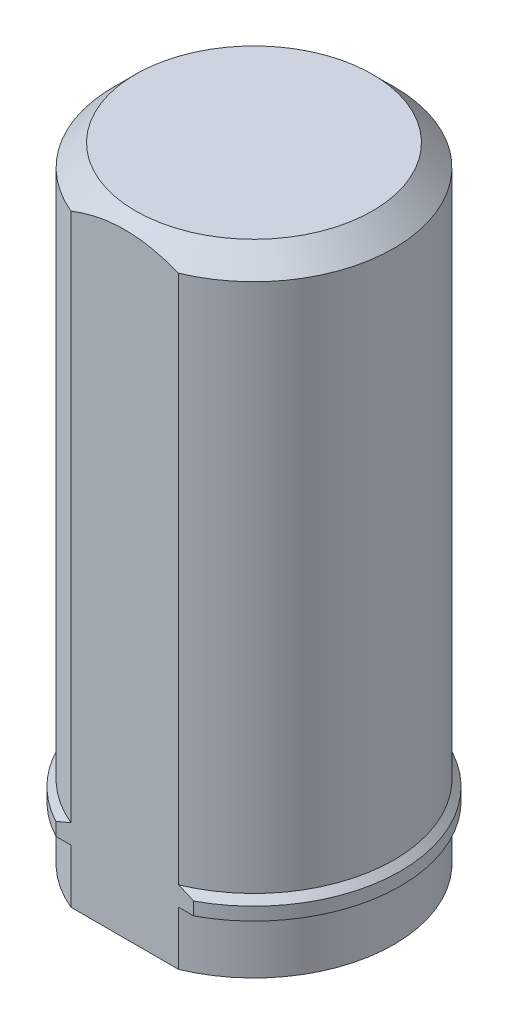
ISO-10303-21;
HEADER;
FILE_DESCRIPTION(('STEP AP214'),'2;1');
FILE_NAME('part.step','',(''),(''),'','','');
FILE_SCHEMA(('AUTOMOTIVE_DESIGN { 1 0 10303 214 1 1 1 1 }'));
ENDSEC;
DATA;
#1=APPLICATION_CONTEXT('core data for automotive mechanical design processes');
#2=APPLICATION_PROTOCOL_DEFINITION('international standard','automotive_design',2000,#1);
#3=PRODUCT_CONTEXT('',#1,'mechanical');
#4=PRODUCT('Part','Part','',(#3));
#5=PRODUCT_RELATED_PRODUCT_CATEGORY('part','',(#4));
#6=PRODUCT_DEFINITION_FORMATION('','',#4);
#7=PRODUCT_DEFINITION_CONTEXT('part definition',#1,'design');
#8=PRODUCT_DEFINITION('design','',#6,#7);
#9=PRODUCT_DEFINITION_SHAPE('','',#8);
#10=(LENGTH_UNIT() NAMED_UNIT(*) SI_UNIT(.MILLI.,.METRE.));
#11=(NAMED_UNIT(*) PLANE_ANGLE_UNIT() SI_UNIT($,.RADIAN.));
#12=(NAMED_UNIT(*) SI_UNIT($,.STERADIAN.) SOLID_ANGLE_UNIT());
#13=UNCERTAINTY_MEASURE_WITH_UNIT(LENGTH_MEASURE(1.E-05),#10,'distance_accuracy_value','');
#14=(GEOMETRIC_REPRESENTATION_CONTEXT(3) GLOBAL_UNCERTAINTY_ASSIGNED_CONTEXT((#13)) GLOBAL_UNIT_ASSIGNED_CONTEXT((#10,
#11,#12)) REPRESENTATION_CONTEXT('',''));
#15=CARTESIAN_POINT('',(0.,0.,0.));
#16=DIRECTION('',(0.,0.,1.));
#17=DIRECTION('',(1.,0.,0.));
#18=AXIS2_PLACEMENT_3D('',#15,#16,#17);
#19=CARTESIAN_POINT('',(0.,7.25,0.));
#20=DIRECTION('',(0.,-1.,0.));
#21=DIRECTION('',(0.,0.,-1.));
#22=AXIS2_PLACEMENT_3D('',#19,#20,#21);
#23=CYLINDRICAL_SURFACE('',#22,3.25);
#24=DIRECTION('',(0.,-1.,0.));
#25=VECTOR('',#24,1.);
#26=CARTESIAN_POINT('',(-1.25,7.25,3.));
#27=LINE('',#26,#25);
#28=CARTESIAN_POINT('',(-1.25,6.75000000000001,3.));
#29=VERTEX_POINT('',#28);
#30=CARTESIAN_POINT('',(-1.25,-5.55,3.));
#31=VERTEX_POINT('',#30);
#32=EDGE_CURVE('E153',#29,#31,#27,.T.);
#33=ORIENTED_EDGE('',*,*,#32,.F.);
#34=CARTESIAN_POINT('',(0.,6.75000000000001,0.));
#35=DIRECTION('',(0.,1.,0.));
#36=DIRECTION('',(0.,0.,1.));
#37=AXIS2_PLACEMENT_3D('',#34,#35,#36);
#38=CIRCLE('',#37,3.25);
#39=CARTESIAN_POINT('',(1.25,6.75000000000001,3.));
#40=VERTEX_POINT('',#39);
#41=EDGE_CURVE('E61',#29,#40,#38,.F.);
#42=ORIENTED_EDGE('',*,*,#41,.T.);
#43=DIRECTION('',(0.,-1.,0.));
#44=VECTOR('',#43,1.);
#45=CARTESIAN_POINT('',(1.25,7.25,3.));
#46=LINE('',#45,#44);
#47=CARTESIAN_POINT('',(1.25,-5.55,3.));
#48=VERTEX_POINT('',#47);
#49=EDGE_CURVE('E149',#40,#48,#46,.T.);
#50=ORIENTED_EDGE('',*,*,#49,.T.);
#51=CARTESIAN_POINT('',(0.,-5.55,0.));
#52=DIRECTION('',(0.,-1.,0.));
#53=DIRECTION('',(0.,0.,-1.));
#54=AXIS2_PLACEMENT_3D('',#51,#52,#53);
#55=CIRCLE('',#54,3.25);
#56=EDGE_CURVE('E217',#48,#31,#55,.F.);
#57=ORIENTED_EDGE('',*,*,#56,.T.);
#58=EDGE_LOOP('',(#33,#42,#50,#57));
#59=FACE_BOUND('',#58,.T.);
#60=ADVANCED_FACE('F45',(#59),#23,.T.);
#61=CARTESIAN_POINT('',(-1.25,-6.,3.));
#62=VERTEX_POINT('',#61);
#63=CARTESIAN_POINT('',(-1.25,-7.25,3.));
#64=VERTEX_POINT('',#63);
#65=EDGE_CURVE('E152',#62,#64,#27,.T.);
#66=ORIENTED_EDGE('',*,*,#65,.F.);
#67=CARTESIAN_POINT('',(0.,-6.,0.));
#68=DIRECTION('',(0.,1.,0.));
#69=DIRECTION('',(0.,0.,-1.));
#70=AXIS2_PLACEMENT_3D('',#67,#68,#69);
#71=CIRCLE('',#70,3.25);
#72=CARTESIAN_POINT('',(1.25,-6.,3.));
#73=VERTEX_POINT('',#72);
#74=EDGE_CURVE('E130',#73,#62,#71,.T.);
#75=ORIENTED_EDGE('',*,*,#74,.F.);
#76=CARTESIAN_POINT('',(1.25,-7.25,3.));
#77=VERTEX_POINT('',#76);
#78=EDGE_CURVE('E148',#73,#77,#46,.T.);
#79=ORIENTED_EDGE('',*,*,#78,.T.);
#80=CARTESIAN_POINT('',(0.,-7.25,0.));
#81=DIRECTION('',(0.,1.,0.));
#82=DIRECTION('',(0.,0.,1.));
#83=AXIS2_PLACEMENT_3D('',#80,#81,#82);
#84=CIRCLE('',#83,3.25);
#85=EDGE_CURVE('E139',#77,#64,#84,.T.);
#86=ORIENTED_EDGE('',*,*,#85,.T.);
#87=EDGE_LOOP('',(#66,#75,#79,#86));
#88=FACE_BOUND('',#87,.T.);
#89=ADVANCED_FACE('F179',(#88),#23,.T.);
#90=CARTESIAN_POINT('',(-1.25,7.25,3.));
#91=DIRECTION('',(0.,0.,-1.));
#92=DIRECTION('',(-1.,0.,0.));
#93=AXIS2_PLACEMENT_3D('',#90,#91,#92);
#94=PLANE('',#93);
#95=ORIENTED_EDGE('',*,*,#49,.F.);
#96=CARTESIAN_POINT('',(1.25,6.75000000000001,3.));
#97=CARTESIAN_POINT('',(1.15236802083106,6.78757188208299,3.));
#98=CARTESIAN_POINT('',(1.05336204969655,6.82188542634082,3.));
#99=CARTESIAN_POINT('',(0.852725448941352,6.88262653176156,3.));
#100=CARTESIAN_POINT('',(0.751089244504003,6.90903554399201,3.));
#101=CARTESIAN_POINT('',(0.548493250122635,6.95183525854424,3.));
#102=CARTESIAN_POINT('',(0.447586877927032,6.96847284308401,3.));
#103=CARTESIAN_POINT('',(0.244706115081653,6.99172007793595,3.));
#104=CARTESIAN_POINT('',(0.142732885989921,6.99833968153455,3.));
#105=CARTESIAN_POINT('',(-0.0578920074181172,7.00106149910393,3.));
#106=CARTESIAN_POINT('',(-0.156538957355593,6.99751300022703,3.));
#107=CARTESIAN_POINT('',(-0.353047249224431,6.98088604181037,3.));
#108=CARTESIAN_POINT('',(-0.450908287707392,6.96780406478675,3.));
#109=CARTESIAN_POINT('',(-0.646385819993977,6.93268347225142,3.));
#110=CARTESIAN_POINT('',(-0.743980132667017,6.91052325206171,3.));
#111=CARTESIAN_POINT('',(-0.937016203307972,6.85844563947066,3.));
#112=CARTESIAN_POINT('',(-1.03245832486016,6.82852956815261,3.));
#113=CARTESIAN_POINT('',(-1.32842957153947,6.72448834521904,3.));
#114=CARTESIAN_POINT('',(-1.52490969147314,6.63880361319598,3.));
#115=CARTESIAN_POINT('',(-1.81250176256392,6.49596689601506,3.));
#116=CARTESIAN_POINT('',(-1.9073559585764,6.44585780163771,3.));
#117=CARTESIAN_POINT('',(-2.0949245865654,6.34177437885116,3.));
#118=CARTESIAN_POINT('',(-2.18763938699841,6.28780072268413,3.));
#119=CARTESIAN_POINT('',(-2.36803930017189,6.17866081112151,3.));
#120=CARTESIAN_POINT('',(-2.45578798483036,6.12359847408629,3.));
#121=CARTESIAN_POINT('',(-2.62976374299445,6.01110837336085,3.));
#122=CARTESIAN_POINT('',(-2.71599069300595,5.95368041894191,3.));
#123=CARTESIAN_POINT('',(-2.88641961075783,5.83736099464282,3.));
#124=CARTESIAN_POINT('',(-2.97063234675969,5.77848523625161,3.));
#125=CARTESIAN_POINT('',(-3.13789321586835,5.65915034019606,3.));
#126=CARTESIAN_POINT('',(-3.22094167668753,5.59869166240205,3.));
#127=CARTESIAN_POINT('',(-3.30350342880282,5.5375864261465,3.));
#128=B_SPLINE_CURVE_WITH_KNOTS('',3,(#96,#97,#98,#99,#100,#101,#102,#103,#104,#105,#106,#107,
#108,#109,#110,#111,#112,#113,#114,#115,#116,#117,#118,#119,#120,#121,#122,#123,#124,#125,#126,
#127),.UNSPECIFIED.,.F.,.F.,(4,2,2,2,2,2,2,2,2,2,2,2,2,2,2,4),(0.,0.313947136940306,
0.628625314452548,0.934966611069564,1.24100334441469,1.53665464320436,1.83241508112558,
2.13227402606719,2.43208192842626,3.07316816171329,3.39497040337172,3.71671680275454,
4.02745936200869,4.33822702421668,4.64646590327191,4.95461620513625),.UNSPECIFIED.);
#129=EDGE_CURVE('E11',#40,#29,#128,.T.);
#130=ORIENTED_EDGE('',*,*,#129,.T.);
#131=ORIENTED_EDGE('',*,*,#32,.T.);
#132=CARTESIAN_POINT('',(-1.25,-5.55,3.));
#133=CARTESIAN_POINT('',(-1.27962939360583,-5.56139609884944,3.));
#134=CARTESIAN_POINT('',(-1.30914257840903,-5.57309239251102,3.));
#135=CARTESIAN_POINT('',(-1.36792931558873,-5.59704565204702,3.));
#136=CARTESIAN_POINT('',(-1.39720294374067,-5.60930243185636,3.));
#137=CARTESIAN_POINT('',(-1.45552217219404,-5.63434420136298,3.));
#138=CARTESIAN_POINT('',(-1.48456777802003,-5.64712917821573,3.));
#139=CARTESIAN_POINT('',(-1.54244546525888,-5.67319887731223,3.));
#140=CARTESIAN_POINT('',(-1.5712774731186,-5.68648376292557,3.));
#141=CARTESIAN_POINT('',(-1.60000000000004,-5.69999999999991,3.));
#142=B_SPLINE_CURVE_WITH_KNOTS('',3,(#132,#133,#134,#135,#136,#137,#138,#139,#140,#141),
.UNSPECIFIED.,.F.,.F.,(4,2,2,2,4),(0.,0.0952336420884847,0.190435895693011,0.285635835561755,
0.380867161552524),.UNSPECIFIED.);
#143=CARTESIAN_POINT('',(-1.6,-5.7,3.));
#144=VERTEX_POINT('',#143);
#145=EDGE_CURVE('E112',#31,#144,#142,.T.);
#146=ORIENTED_EDGE('',*,*,#145,.T.);
#147=DIRECTION('',(0.,-1.,0.));
#148=VECTOR('',#147,1.);
#149=CARTESIAN_POINT('',(-1.6,-5.5,3.));
#150=LINE('',#149,#148);
#151=CARTESIAN_POINT('',(-1.6,-6.,3.));
#152=VERTEX_POINT('',#151);
#153=EDGE_CURVE('E105',#144,#152,#150,.T.);
#154=ORIENTED_EDGE('',*,*,#153,.T.);
#155=DIRECTION('',(-1.,0.,0.));
#156=VECTOR('',#155,1.);
#157=CARTESIAN_POINT('',(-1.25,-6.,3.));
#158=LINE('',#157,#156);
#159=EDGE_CURVE('E109',#62,#152,#158,.T.);
#160=ORIENTED_EDGE('',*,*,#159,.F.);
#161=ORIENTED_EDGE('',*,*,#65,.T.);
#162=DIRECTION('',(1.,0.,0.));
#163=VECTOR('',#162,1.);
#164=CARTESIAN_POINT('',(-1.25,-7.25,3.));
#165=LINE('',#164,#163);
#166=EDGE_CURVE('E144',#64,#77,#165,.T.);
#167=ORIENTED_EDGE('',*,*,#166,.T.);
#168=ORIENTED_EDGE('',*,*,#78,.F.);
#169=DIRECTION('',(-1.,0.,0.));
#170=VECTOR('',#169,1.);
#171=CARTESIAN_POINT('',(1.25,-6.,3.));
#172=LINE('',#171,#170);
#173=CARTESIAN_POINT('',(1.6,-6.,3.));
#174=VERTEX_POINT('',#173);
#175=EDGE_CURVE('E118',#174,#73,#172,.T.);
#176=ORIENTED_EDGE('',*,*,#175,.F.);
#177=DIRECTION('',(0.,-1.,0.));
#178=VECTOR('',#177,1.);
#179=CARTESIAN_POINT('',(1.6,-5.5,3.));
#180=LINE('',#179,#178);
#181=CARTESIAN_POINT('',(1.6,-5.7,3.));
#182=VERTEX_POINT('',#181);
#183=EDGE_CURVE('E117',#182,#174,#180,.T.);
#184=ORIENTED_EDGE('',*,*,#183,.F.);
#185=CARTESIAN_POINT('',(1.6,-5.7,3.));
#186=CARTESIAN_POINT('',(1.57127747311859,-5.68648376292561,3.));
#187=CARTESIAN_POINT('',(1.54244546525888,-5.67319887731224,3.));
#188=CARTESIAN_POINT('',(1.48456777802004,-5.64712917821572,3.));
#189=CARTESIAN_POINT('',(1.45552217219405,-5.63434420136297,3.));
#190=CARTESIAN_POINT('',(1.39720294374067,-5.60930243185637,3.));
#191=CARTESIAN_POINT('',(1.36792931558873,-5.59704565204706,3.));
#192=CARTESIAN_POINT('',(1.30914257840906,-5.573092392511,3.));
#193=CARTESIAN_POINT('',(1.2796293936059,-5.56139609884933,3.));
#194=CARTESIAN_POINT('',(1.25000000000015,-5.54999999999969,3.));
#195=B_SPLINE_CURVE_WITH_KNOTS('',3,(#185,#186,#187,#188,#189,#190,#191,#192,#193,#194),
.UNSPECIFIED.,.F.,.F.,(4,2,2,2,4),(0.,0.0952313259907674,0.190431265859512,0.285633519464033,
0.380867161552509),.UNSPECIFIED.);
#196=EDGE_CURVE('E165',#182,#48,#195,.T.);
#197=ORIENTED_EDGE('',*,*,#196,.T.);
#198=EDGE_LOOP('',(#95,#130,#131,#146,#154,#160,#161,#167,#168,#176,#184,#197));
#199=FACE_BOUND('',#198,.T.);
#200=ADVANCED_FACE('F107',(#199),#94,.F.);
#201=CARTESIAN_POINT('',(0.,7.25,0.));
#202=DIRECTION('',(0.,1.,0.));
#203=DIRECTION('',(0.,0.,1.));
#204=AXIS2_PLACEMENT_3D('',#201,#202,#203);
#205=PLANE('',#204);
#206=CARTESIAN_POINT('',(0.,7.25,0.));
#207=DIRECTION('',(0.,1.,0.));
#208=DIRECTION('',(0.,0.,1.));
#209=AXIS2_PLACEMENT_3D('',#206,#207,#208);
#210=CIRCLE('',#209,2.75000000000001);
#211=CARTESIAN_POINT('',(1.05769230769231,7.25,2.53846153846155));
#212=VERTEX_POINT('',#211);
#213=EDGE_CURVE('E66',#212,#212,#210,.T.);
#214=ORIENTED_EDGE('',*,*,#213,.T.);
#215=EDGE_LOOP('',(#214));
#216=FACE_BOUND('',#215,.T.);
#217=ADVANCED_FACE('F178',(#216),#205,.T.);
#218=CARTESIAN_POINT('',(0.,-7.25,0.));
#219=DIRECTION('',(0.,1.,0.));
#220=DIRECTION('',(0.,0.,1.));
#221=AXIS2_PLACEMENT_3D('',#218,#219,#220);
#222=PLANE('',#221);
#223=ORIENTED_EDGE('',*,*,#85,.F.);
#224=ORIENTED_EDGE('',*,*,#166,.F.);
#225=EDGE_LOOP('',(#223,#224));
#226=FACE_BOUND('',#225,.T.);
#227=ADVANCED_FACE('F180',(#226),#222,.F.);
#228=CARTESIAN_POINT('',(0.,-5.5,0.));
#229=DIRECTION('',(0.,-1.,0.));
#230=DIRECTION('',(0.,0.,-1.));
#231=AXIS2_PLACEMENT_3D('',#228,#229,#230);
#232=CYLINDRICAL_SURFACE('',#231,3.4);
#233=ORIENTED_EDGE('',*,*,#153,.F.);
#234=CARTESIAN_POINT('',(0.,-5.7,0.));
#235=DIRECTION('',(0.,-1.,0.));
#236=DIRECTION('',(0.,0.,-1.));
#237=AXIS2_PLACEMENT_3D('',#234,#235,#236);
#238=CIRCLE('',#237,3.4);
#239=EDGE_CURVE('E156',#144,#182,#238,.T.);
#240=ORIENTED_EDGE('',*,*,#239,.T.);
#241=ORIENTED_EDGE('',*,*,#183,.T.);
#242=CARTESIAN_POINT('',(0.,-6.,0.));
#243=DIRECTION('',(0.,-1.,0.));
#244=DIRECTION('',(0.,0.,-1.));
#245=AXIS2_PLACEMENT_3D('',#242,#243,#244);
#246=CIRCLE('',#245,3.4);
#247=EDGE_CURVE('E121',#152,#174,#246,.T.);
#248=ORIENTED_EDGE('',*,*,#247,.F.);
#249=EDGE_LOOP('',(#233,#240,#241,#248));
#250=FACE_BOUND('',#249,.T.);
#251=ADVANCED_FACE('F122',(#250),#232,.T.);
#252=CARTESIAN_POINT('',(0.,-6.,0.));
#253=DIRECTION('',(0.,-1.,0.));
#254=DIRECTION('',(0.,0.,-1.));
#255=AXIS2_PLACEMENT_3D('',#252,#253,#254);
#256=PLANE('',#255);
#257=ORIENTED_EDGE('',*,*,#74,.T.);
#258=ORIENTED_EDGE('',*,*,#159,.T.);
#259=ORIENTED_EDGE('',*,*,#247,.T.);
#260=ORIENTED_EDGE('',*,*,#175,.T.);
#261=EDGE_LOOP('',(#257,#258,#259,#260));
#262=FACE_BOUND('',#261,.T.);
#263=ADVANCED_FACE('F128',(#262),#256,.T.);
#264=CARTESIAN_POINT('',(0.,-5.7,0.));
#265=DIRECTION('',(0.,-1.,0.));
#266=DIRECTION('',(0.,0.,-1.));
#267=AXIS2_PLACEMENT_3D('',#264,#265,#266);
#268=CONICAL_SURFACE('',#267,3.4,0.785398163397444);
#269=ORIENTED_EDGE('',*,*,#145,.F.);
#270=ORIENTED_EDGE('',*,*,#56,.F.);
#271=ORIENTED_EDGE('',*,*,#196,.F.);
#272=ORIENTED_EDGE('',*,*,#239,.F.);
#273=EDGE_LOOP('',(#269,#270,#271,#272));
#274=FACE_BOUND('',#273,.T.);
#275=ADVANCED_FACE('F172',(#274),#268,.T.);
#276=CARTESIAN_POINT('',(0.,7.25,0.));
#277=DIRECTION('',(0.,-1.,0.));
#278=DIRECTION('',(0.,0.,-1.));
#279=AXIS2_PLACEMENT_3D('',#276,#277,#278);
#280=CONICAL_SURFACE('',#279,2.75000000000001,0.785398163397447);
#281=ORIENTED_EDGE('',*,*,#129,.F.);
#282=ORIENTED_EDGE('',*,*,#41,.F.);
#283=EDGE_LOOP('',(#281,#282));
#284=FACE_BOUND('',#283,.T.);
#285=ORIENTED_EDGE('',*,*,#213,.F.);
#286=EDGE_LOOP('',(#285));
#287=FACE_BOUND('',#286,.T.);
#288=ADVANCED_FACE('F48',(#284,#287),#280,.T.);
#289=CLOSED_SHELL('',(#60,#89,#200,#217,#227,#251,#263,#275,#288));
#290=MANIFOLD_SOLID_BREP('B2',#289);
#291=ADVANCED_BREP_SHAPE_REPRESENTATION('',(#18,#290),#14);
#292=SHAPE_DEFINITION_REPRESENTATION(#9,#291);
ENDSEC;
END-ISO-10303-21;
